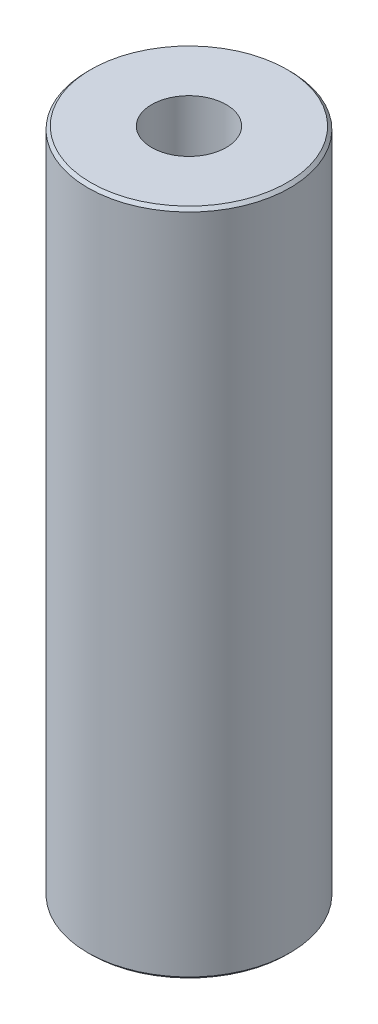
ISO-10303-21;
HEADER;
FILE_DESCRIPTION(('STEP AP214'),'2;1');
FILE_NAME('part.step','',(''),(''),'','','');
FILE_SCHEMA(('AUTOMOTIVE_DESIGN { 1 0 10303 214 1 1 1 1 }'));
ENDSEC;
DATA;
#1=APPLICATION_CONTEXT('core data for automotive mechanical design processes');
#2=APPLICATION_PROTOCOL_DEFINITION('international standard','automotive_design',2000,#1);
#3=PRODUCT_CONTEXT('',#1,'mechanical');
#4=PRODUCT('Part','Part','',(#3));
#5=PRODUCT_RELATED_PRODUCT_CATEGORY('part','',(#4));
#6=PRODUCT_DEFINITION_FORMATION('','',#4);
#7=PRODUCT_DEFINITION_CONTEXT('part definition',#1,'design');
#8=PRODUCT_DEFINITION('design','',#6,#7);
#9=PRODUCT_DEFINITION_SHAPE('','',#8);
#10=(LENGTH_UNIT() NAMED_UNIT(*) SI_UNIT(.MILLI.,.METRE.));
#11=(NAMED_UNIT(*) PLANE_ANGLE_UNIT() SI_UNIT($,.RADIAN.));
#12=(NAMED_UNIT(*) SI_UNIT($,.STERADIAN.) SOLID_ANGLE_UNIT());
#13=UNCERTAINTY_MEASURE_WITH_UNIT(LENGTH_MEASURE(1.E-05),#10,'distance_accuracy_value','');
#14=(GEOMETRIC_REPRESENTATION_CONTEXT(3) GLOBAL_UNCERTAINTY_ASSIGNED_CONTEXT((#13)) GLOBAL_UNIT_ASSIGNED_CONTEXT((#10,
#11,#12)) REPRESENTATION_CONTEXT('',''));
#15=CARTESIAN_POINT('',(0.,0.,0.));
#16=DIRECTION('',(0.,0.,1.));
#17=DIRECTION('',(1.,0.,0.));
#18=AXIS2_PLACEMENT_3D('',#15,#16,#17);
#19=CARTESIAN_POINT('',(0.,396.776497742331,0.));
#20=DIRECTION('',(0.,-1.,0.));
#21=DIRECTION('',(0.,0.,-1.));
#22=AXIS2_PLACEMENT_3D('',#19,#20,#21);
#23=CYLINDRICAL_SURFACE('',#22,60.);
#24=CARTESIAN_POINT('',(0.,394.995009691105,0.));
#25=DIRECTION('',(0.,1.,0.));
#26=DIRECTION('',(0.,0.,1.));
#27=AXIS2_PLACEMENT_3D('',#24,#25,#26);
#28=CIRCLE('',#27,60.);
#29=CARTESIAN_POINT('',(0.,394.995009691105,60.));
#30=VERTEX_POINT('',#29);
#31=EDGE_CURVE('E50',#30,#30,#28,.F.);
#32=ORIENTED_EDGE('',*,*,#31,.T.);
#33=EDGE_LOOP('',(#32));
#34=FACE_BOUND('',#33,.T.);
#35=CARTESIAN_POINT('',(0.,1.78148805122635,0.));
#36=DIRECTION('',(0.,1.,0.));
#37=DIRECTION('',(0.,0.,1.));
#38=AXIS2_PLACEMENT_3D('',#35,#36,#37);
#39=CIRCLE('',#38,60.);
#40=CARTESIAN_POINT('',(0.,1.78148805122635,60.));
#41=VERTEX_POINT('',#40);
#42=EDGE_CURVE('E51',#41,#41,#39,.T.);
#43=ORIENTED_EDGE('',*,*,#42,.T.);
#44=EDGE_LOOP('',(#43));
#45=FACE_BOUND('',#44,.T.);
#46=ADVANCED_FACE('F39',(#34,#45),#23,.T.);
#47=CARTESIAN_POINT('',(0.,396.776497742331,0.));
#48=DIRECTION('',(0.,1.,0.));
#49=DIRECTION('',(0.,0.,1.));
#50=AXIS2_PLACEMENT_3D('',#47,#48,#49);
#51=PLANE('',#50);
#52=CARTESIAN_POINT('',(0.,396.776497742331,0.));
#53=DIRECTION('',(0.,1.,0.));
#54=DIRECTION('',(0.,0.,1.));
#55=AXIS2_PLACEMENT_3D('',#52,#53,#54);
#56=CIRCLE('',#55,58.2185119487736);
#57=CARTESIAN_POINT('',(0.,396.776497742331,58.2185119487736));
#58=VERTEX_POINT('',#57);
#59=EDGE_CURVE('E54',#58,#58,#56,.T.);
#60=ORIENTED_EDGE('',*,*,#59,.T.);
#61=EDGE_LOOP('',(#60));
#62=FACE_BOUND('',#61,.T.);
#63=CARTESIAN_POINT('',(0.,396.776497742331,0.));
#64=DIRECTION('',(0.,1.,0.));
#65=DIRECTION('',(0.,0.,1.));
#66=AXIS2_PLACEMENT_3D('',#63,#64,#65);
#67=CIRCLE('',#66,22.115309307255);
#68=CARTESIAN_POINT('',(0.,396.776497742331,22.115309307255));
#69=VERTEX_POINT('',#68);
#70=EDGE_CURVE('E58',#69,#69,#67,.T.);
#71=ORIENTED_EDGE('',*,*,#70,.F.);
#72=EDGE_LOOP('',(#71));
#73=FACE_BOUND('',#72,.T.);
#74=ADVANCED_FACE('F69',(#62,#73),#51,.T.);
#75=CARTESIAN_POINT('',(0.,0.,0.));
#76=DIRECTION('',(0.,1.,0.));
#77=DIRECTION('',(0.,0.,1.));
#78=AXIS2_PLACEMENT_3D('',#75,#76,#77);
#79=PLANE('',#78);
#80=CARTESIAN_POINT('',(0.,0.,0.));
#81=DIRECTION('',(0.,1.,0.));
#82=DIRECTION('',(0.,0.,1.));
#83=AXIS2_PLACEMENT_3D('',#80,#81,#82);
#84=CIRCLE('',#83,58.2185119487736);
#85=CARTESIAN_POINT('',(0.,0.,58.2185119487736));
#86=VERTEX_POINT('',#85);
#87=EDGE_CURVE('E10',#86,#86,#84,.F.);
#88=ORIENTED_EDGE('',*,*,#87,.T.);
#89=EDGE_LOOP('',(#88));
#90=FACE_BOUND('',#89,.T.);
#91=CARTESIAN_POINT('',(0.,0.,0.));
#92=DIRECTION('',(0.,1.,0.));
#93=DIRECTION('',(0.,0.,1.));
#94=AXIS2_PLACEMENT_3D('',#91,#92,#93);
#95=CIRCLE('',#94,22.115309307255);
#96=CARTESIAN_POINT('',(0.,0.,22.115309307255));
#97=VERTEX_POINT('',#96);
#98=EDGE_CURVE('E63',#97,#97,#95,.T.);
#99=ORIENTED_EDGE('',*,*,#98,.T.);
#100=EDGE_LOOP('',(#99));
#101=FACE_BOUND('',#100,.T.);
#102=ADVANCED_FACE('F75',(#90,#101),#79,.F.);
#103=CARTESIAN_POINT('',(0.,396.776497742331,0.));
#104=DIRECTION('',(0.,-1.,0.));
#105=DIRECTION('',(0.,0.,-1.));
#106=AXIS2_PLACEMENT_3D('',#103,#104,#105);
#107=CYLINDRICAL_SURFACE('',#106,22.115309307255);
#108=ORIENTED_EDGE('',*,*,#70,.T.);
#109=EDGE_LOOP('',(#108));
#110=FACE_BOUND('',#109,.T.);
#111=ORIENTED_EDGE('',*,*,#98,.F.);
#112=EDGE_LOOP('',(#111));
#113=FACE_BOUND('',#112,.T.);
#114=ADVANCED_FACE('F70',(#110,#113),#107,.F.);
#115=CARTESIAN_POINT('',(0.,396.776497742331,0.));
#116=DIRECTION('',(0.,-1.,0.));
#117=DIRECTION('',(0.,0.,-1.));
#118=AXIS2_PLACEMENT_3D('',#115,#116,#117);
#119=CONICAL_SURFACE('',#118,58.2185119487736,0.785398163397464);
#120=ORIENTED_EDGE('',*,*,#31,.F.);
#121=EDGE_LOOP('',(#120));
#122=FACE_BOUND('',#121,.T.);
#123=ORIENTED_EDGE('',*,*,#59,.F.);
#124=EDGE_LOOP('',(#123));
#125=FACE_BOUND('',#124,.T.);
#126=ADVANCED_FACE('F81',(#122,#125),#119,.T.);
#127=CARTESIAN_POINT('',(0.,1.78148805122635,0.));
#128=DIRECTION('',(0.,1.,0.));
#129=DIRECTION('',(0.,0.,1.));
#130=AXIS2_PLACEMENT_3D('',#127,#128,#129);
#131=CONICAL_SURFACE('',#130,60.,0.785398163397448);
#132=ORIENTED_EDGE('',*,*,#87,.F.);
#133=EDGE_LOOP('',(#132));
#134=FACE_BOUND('',#133,.T.);
#135=ORIENTED_EDGE('',*,*,#42,.F.);
#136=EDGE_LOOP('',(#135));
#137=FACE_BOUND('',#136,.T.);
#138=ADVANCED_FACE('F45',(#134,#137),#131,.T.);
#139=CLOSED_SHELL('',(#46,#74,#102,#114,#126,#138));
#140=MANIFOLD_SOLID_BREP('B2',#139);
#141=ADVANCED_BREP_SHAPE_REPRESENTATION('',(#18,#140),#14);
#142=SHAPE_DEFINITION_REPRESENTATION(#9,#141);
ENDSEC;
END-ISO-10303-21;
